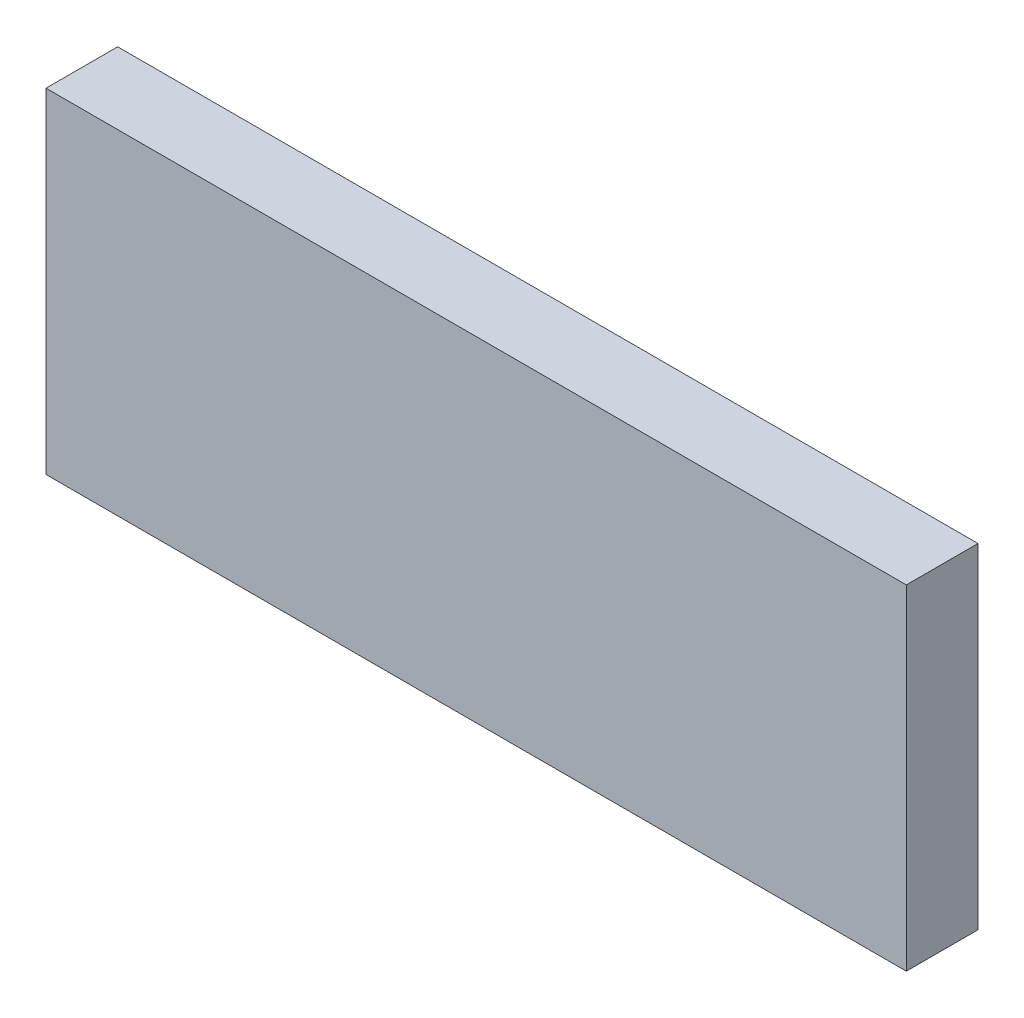
ISO-10303-21;
HEADER;
FILE_DESCRIPTION(('STEP AP214'),'2;1');
FILE_NAME('part.step','',(''),(''),'','','');
FILE_SCHEMA(('AUTOMOTIVE_DESIGN { 1 0 10303 214 1 1 1 1 }'));
ENDSEC;
DATA;
#1=APPLICATION_CONTEXT('core data for automotive mechanical design processes');
#2=APPLICATION_PROTOCOL_DEFINITION('international standard','automotive_design',2000,#1);
#3=PRODUCT_CONTEXT('',#1,'mechanical');
#4=PRODUCT('Part','Part','',(#3));
#5=PRODUCT_RELATED_PRODUCT_CATEGORY('part','',(#4));
#6=PRODUCT_DEFINITION_FORMATION('','',#4);
#7=PRODUCT_DEFINITION_CONTEXT('part definition',#1,'design');
#8=PRODUCT_DEFINITION('design','',#6,#7);
#9=PRODUCT_DEFINITION_SHAPE('','',#8);
#10=(LENGTH_UNIT() NAMED_UNIT(*) SI_UNIT(.MILLI.,.METRE.));
#11=(NAMED_UNIT(*) PLANE_ANGLE_UNIT() SI_UNIT($,.RADIAN.));
#12=(NAMED_UNIT(*) SI_UNIT($,.STERADIAN.) SOLID_ANGLE_UNIT());
#13=UNCERTAINTY_MEASURE_WITH_UNIT(LENGTH_MEASURE(1.E-05),#10,'distance_accuracy_value','');
#14=(GEOMETRIC_REPRESENTATION_CONTEXT(3) GLOBAL_UNCERTAINTY_ASSIGNED_CONTEXT((#13)) GLOBAL_UNIT_ASSIGNED_CONTEXT((#10,
#11,#12)) REPRESENTATION_CONTEXT('',''));
#15=CARTESIAN_POINT('',(0.,0.,0.));
#16=DIRECTION('',(0.,0.,1.));
#17=DIRECTION('',(1.,0.,0.));
#18=AXIS2_PLACEMENT_3D('',#15,#16,#17);
#19=CARTESIAN_POINT('',(0.,0.,0.));
#20=DIRECTION('',(0.,0.,1.));
#21=DIRECTION('',(1.,0.,0.));
#22=AXIS2_PLACEMENT_3D('',#19,#20,#21);
#23=PLANE('',#22);
#24=DIRECTION('',(1.,0.,0.));
#25=VECTOR('',#24,1.);
#26=CARTESIAN_POINT('',(1.95,-1.85,0.));
#27=LINE('',#26,#25);
#28=CARTESIAN_POINT('',(3.75,-1.85,0.));
#29=VERTEX_POINT('',#28);
#30=CARTESIAN_POINT('',(1.95,-1.85,0.));
#31=VERTEX_POINT('',#30);
#32=EDGE_CURVE('E80',#29,#31,#27,.F.);
#33=ORIENTED_EDGE('',*,*,#32,.T.);
#34=DIRECTION('',(0.,1.,0.));
#35=VECTOR('',#34,1.);
#36=CARTESIAN_POINT('',(1.95,-1.15,0.));
#37=LINE('',#36,#35);
#38=CARTESIAN_POINT('',(1.95,-1.15,0.));
#39=VERTEX_POINT('',#38);
#40=EDGE_CURVE('E67',#31,#39,#37,.T.);
#41=ORIENTED_EDGE('',*,*,#40,.T.);
#42=DIRECTION('',(1.,0.,0.));
#43=VECTOR('',#42,1.);
#44=CARTESIAN_POINT('',(3.75,-1.15,0.));
#45=LINE('',#44,#43);
#46=CARTESIAN_POINT('',(3.75,-1.15,0.));
#47=VERTEX_POINT('',#46);
#48=EDGE_CURVE('E54',#39,#47,#45,.T.);
#49=ORIENTED_EDGE('',*,*,#48,.T.);
#50=DIRECTION('',(0.,-1.,0.));
#51=VECTOR('',#50,1.);
#52=CARTESIAN_POINT('',(3.75,-1.85,0.));
#53=LINE('',#52,#51);
#54=EDGE_CURVE('E19',#47,#29,#53,.T.);
#55=ORIENTED_EDGE('',*,*,#54,.T.);
#56=EDGE_LOOP('',(#33,#41,#49,#55));
#57=FACE_BOUND('',#56,.T.);
#58=ADVANCED_FACE('F16',(#57),#23,.F.);
#59=CARTESIAN_POINT('',(3.75,-1.85,0.15));
#60=DIRECTION('',(-1.,0.,0.));
#61=DIRECTION('',(0.,-1.,0.));
#62=AXIS2_PLACEMENT_3D('',#59,#60,#61);
#63=PLANE('',#62);
#64=DIRECTION('',(0.,0.,1.));
#65=VECTOR('',#64,1.);
#66=CARTESIAN_POINT('',(3.75,-1.15,0.15));
#67=LINE('',#66,#65);
#68=CARTESIAN_POINT('',(3.75,-1.15,0.15));
#69=VERTEX_POINT('',#68);
#70=EDGE_CURVE('E60',#47,#69,#67,.T.);
#71=ORIENTED_EDGE('',*,*,#70,.T.);
#72=DIRECTION('',(0.,1.,0.));
#73=VECTOR('',#72,1.);
#74=CARTESIAN_POINT('',(3.75,0.,0.15));
#75=LINE('',#74,#73);
#76=CARTESIAN_POINT('',(3.75,-1.85,0.15));
#77=VERTEX_POINT('',#76);
#78=EDGE_CURVE('E82',#77,#69,#75,.T.);
#79=ORIENTED_EDGE('',*,*,#78,.F.);
#80=DIRECTION('',(0.,0.,1.));
#81=VECTOR('',#80,1.);
#82=CARTESIAN_POINT('',(3.75,-1.85,0.15));
#83=LINE('',#82,#81);
#84=EDGE_CURVE('E63',#77,#29,#83,.F.);
#85=ORIENTED_EDGE('',*,*,#84,.T.);
#86=ORIENTED_EDGE('',*,*,#54,.F.);
#87=EDGE_LOOP('',(#71,#79,#85,#86));
#88=FACE_BOUND('',#87,.T.);
#89=ADVANCED_FACE('F59',(#88),#63,.F.);
#90=CARTESIAN_POINT('',(3.75,-1.15,0.15));
#91=DIRECTION('',(0.,-1.,0.));
#92=DIRECTION('',(1.,0.,0.));
#93=AXIS2_PLACEMENT_3D('',#90,#91,#92);
#94=PLANE('',#93);
#95=DIRECTION('',(0.,0.,-1.));
#96=VECTOR('',#95,1.);
#97=CARTESIAN_POINT('',(1.95,-1.15,0.15));
#98=LINE('',#97,#96);
#99=CARTESIAN_POINT('',(1.95,-1.15,0.15));
#100=VERTEX_POINT('',#99);
#101=EDGE_CURVE('E69',#39,#100,#98,.F.);
#102=ORIENTED_EDGE('',*,*,#101,.T.);
#103=DIRECTION('',(1.,0.,0.));
#104=VECTOR('',#103,1.);
#105=CARTESIAN_POINT('',(0.,-1.15,0.15));
#106=LINE('',#105,#104);
#107=EDGE_CURVE('E73',#69,#100,#106,.F.);
#108=ORIENTED_EDGE('',*,*,#107,.F.);
#109=ORIENTED_EDGE('',*,*,#70,.F.);
#110=ORIENTED_EDGE('',*,*,#48,.F.);
#111=EDGE_LOOP('',(#102,#108,#109,#110));
#112=FACE_BOUND('',#111,.T.);
#113=ADVANCED_FACE('F71',(#112),#94,.F.);
#114=CARTESIAN_POINT('',(1.95,-1.15,0.15));
#115=DIRECTION('',(1.,0.,0.));
#116=DIRECTION('',(0.,0.,-1.));
#117=AXIS2_PLACEMENT_3D('',#114,#115,#116);
#118=PLANE('',#117);
#119=DIRECTION('',(0.,0.,1.));
#120=VECTOR('',#119,1.);
#121=CARTESIAN_POINT('',(1.95,-1.85,0.15));
#122=LINE('',#121,#120);
#123=CARTESIAN_POINT('',(1.95,-1.85,0.15));
#124=VERTEX_POINT('',#123);
#125=EDGE_CURVE('E34',#31,#124,#122,.T.);
#126=ORIENTED_EDGE('',*,*,#125,.T.);
#127=DIRECTION('',(0.,1.,0.));
#128=VECTOR('',#127,1.);
#129=CARTESIAN_POINT('',(1.95,0.,0.15));
#130=LINE('',#129,#128);
#131=EDGE_CURVE('E25',#100,#124,#130,.F.);
#132=ORIENTED_EDGE('',*,*,#131,.F.);
#133=ORIENTED_EDGE('',*,*,#101,.F.);
#134=ORIENTED_EDGE('',*,*,#40,.F.);
#135=EDGE_LOOP('',(#126,#132,#133,#134));
#136=FACE_BOUND('',#135,.T.);
#137=ADVANCED_FACE('F88',(#136),#118,.F.);
#138=CARTESIAN_POINT('',(1.95,-1.85,0.15));
#139=DIRECTION('',(0.,1.,0.));
#140=DIRECTION('',(0.,0.,1.));
#141=AXIS2_PLACEMENT_3D('',#138,#139,#140);
#142=PLANE('',#141);
#143=ORIENTED_EDGE('',*,*,#84,.F.);
#144=DIRECTION('',(1.,0.,0.));
#145=VECTOR('',#144,1.);
#146=CARTESIAN_POINT('',(0.,-1.85,0.15));
#147=LINE('',#146,#145);
#148=EDGE_CURVE('E11',#124,#77,#147,.T.);
#149=ORIENTED_EDGE('',*,*,#148,.F.);
#150=ORIENTED_EDGE('',*,*,#125,.F.);
#151=ORIENTED_EDGE('',*,*,#32,.F.);
#152=EDGE_LOOP('',(#143,#149,#150,#151));
#153=FACE_BOUND('',#152,.T.);
#154=ADVANCED_FACE('F90',(#153),#142,.F.);
#155=CARTESIAN_POINT('',(0.,0.,0.15));
#156=DIRECTION('',(0.,0.,1.));
#157=DIRECTION('',(1.,0.,0.));
#158=AXIS2_PLACEMENT_3D('',#155,#156,#157);
#159=PLANE('',#158);
#160=ORIENTED_EDGE('',*,*,#131,.T.);
#161=ORIENTED_EDGE('',*,*,#148,.T.);
#162=ORIENTED_EDGE('',*,*,#78,.T.);
#163=ORIENTED_EDGE('',*,*,#107,.T.);
#164=EDGE_LOOP('',(#160,#161,#162,#163));
#165=FACE_BOUND('',#164,.T.);
#166=ADVANCED_FACE('F87',(#165),#159,.T.);
#167=CLOSED_SHELL('',(#58,#89,#113,#137,#154,#166));
#168=MANIFOLD_SOLID_BREP('B1',#167);
#169=ADVANCED_BREP_SHAPE_REPRESENTATION('',(#18,#168),#14);
#170=SHAPE_DEFINITION_REPRESENTATION(#9,#169);
ENDSEC;
END-ISO-10303-21;
